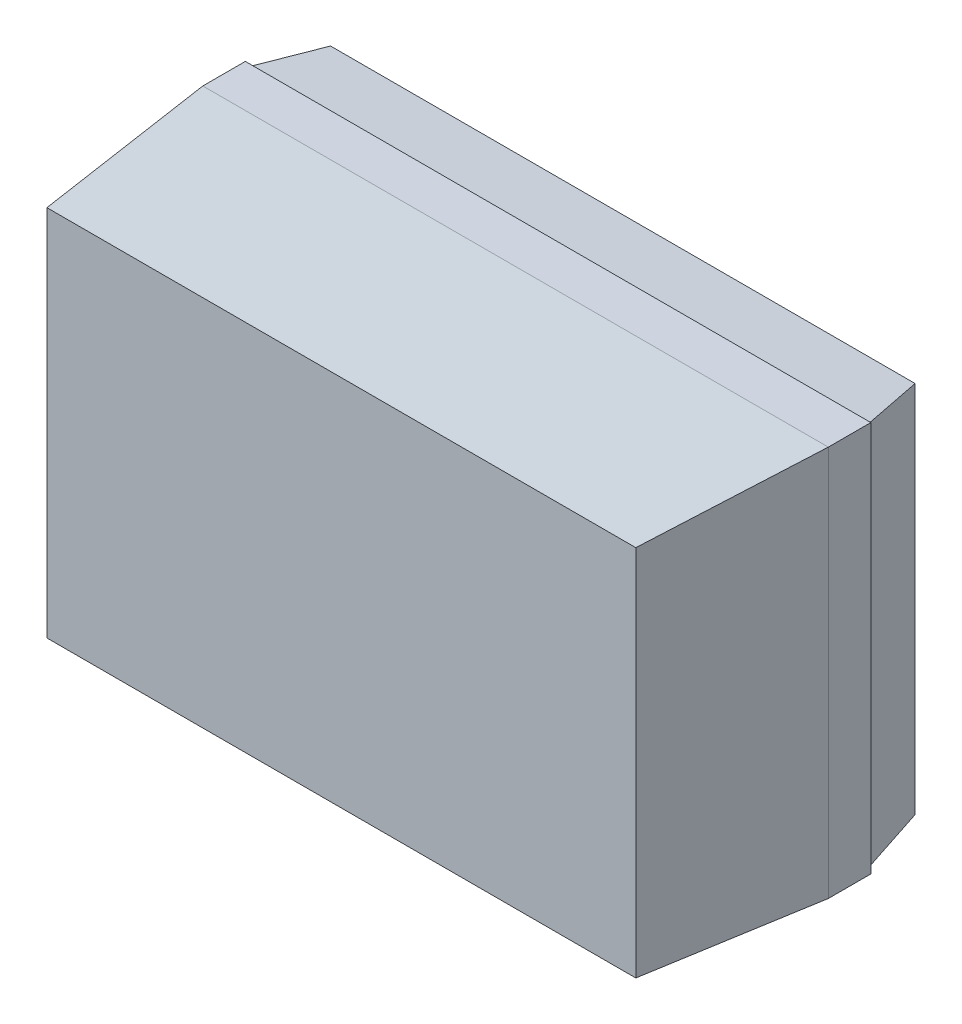
ISO-10303-21;
HEADER;
FILE_DESCRIPTION(('STEP AP214'),'2;1');
FILE_NAME('part.step','',(''),(''),'','','');
FILE_SCHEMA(('AUTOMOTIVE_DESIGN { 1 0 10303 214 1 1 1 1 }'));
ENDSEC;
DATA;
#1=APPLICATION_CONTEXT('core data for automotive mechanical design processes');
#2=APPLICATION_PROTOCOL_DEFINITION('international standard','automotive_design',2000,#1);
#3=PRODUCT_CONTEXT('',#1,'mechanical');
#4=PRODUCT('Part','Part','',(#3));
#5=PRODUCT_RELATED_PRODUCT_CATEGORY('part','',(#4));
#6=PRODUCT_DEFINITION_FORMATION('','',#4);
#7=PRODUCT_DEFINITION_CONTEXT('part definition',#1,'design');
#8=PRODUCT_DEFINITION('design','',#6,#7);
#9=PRODUCT_DEFINITION_SHAPE('','',#8);
#10=(LENGTH_UNIT() NAMED_UNIT(*) SI_UNIT(.MILLI.,.METRE.));
#11=(NAMED_UNIT(*) PLANE_ANGLE_UNIT() SI_UNIT($,.RADIAN.));
#12=(NAMED_UNIT(*) SI_UNIT($,.STERADIAN.) SOLID_ANGLE_UNIT());
#13=UNCERTAINTY_MEASURE_WITH_UNIT(LENGTH_MEASURE(1.E-05),#10,'distance_accuracy_value','');
#14=(GEOMETRIC_REPRESENTATION_CONTEXT(3) GLOBAL_UNCERTAINTY_ASSIGNED_CONTEXT((#13)) GLOBAL_UNIT_ASSIGNED_CONTEXT((#10,
#11,#12)) REPRESENTATION_CONTEXT('',''));
#15=CARTESIAN_POINT('',(0.,0.,0.));
#16=DIRECTION('',(0.,0.,1.));
#17=DIRECTION('',(1.,0.,0.));
#18=AXIS2_PLACEMENT_3D('',#15,#16,#17);
#19=CARTESIAN_POINT('',(1.,0.596889846650134,-0.9));
#20=DIRECTION('',(0.,0.,1.));
#21=DIRECTION('',(0.,-1.,0.));
#22=AXIS2_PLACEMENT_3D('',#19,#20,#21);
#23=PLANE('',#22);
#24=DIRECTION('',(1.,0.,0.));
#25=VECTOR('',#24,1.);
#26=CARTESIAN_POINT('',(1.,-0.596889846650134,-0.9));
#27=LINE('',#26,#25);
#28=CARTESIAN_POINT('',(0.934534517166759,-0.596889846650134,-0.9));
#29=VERTEX_POINT('',#28);
#30=CARTESIAN_POINT('',(-0.934534517166759,-0.596889846650134,-0.9));
#31=VERTEX_POINT('',#30);
#32=EDGE_CURVE('E95',#29,#31,#27,.F.);
#33=ORIENTED_EDGE('',*,*,#32,.T.);
#34=DIRECTION('',(0.,1.,0.));
#35=VECTOR('',#34,1.);
#36=CARTESIAN_POINT('',(-0.934534517166759,-0.625,-0.9));
#37=LINE('',#36,#35);
#38=CARTESIAN_POINT('',(-0.934534517166759,0.596889846650134,-0.9));
#39=VERTEX_POINT('',#38);
#40=EDGE_CURVE('E92',#31,#39,#37,.T.);
#41=ORIENTED_EDGE('',*,*,#40,.T.);
#42=DIRECTION('',(1.,0.,0.));
#43=VECTOR('',#42,1.);
#44=CARTESIAN_POINT('',(1.,0.596889846650134,-0.9));
#45=LINE('',#44,#43);
#46=CARTESIAN_POINT('',(0.934534517166759,0.596889846650134,-0.9));
#47=VERTEX_POINT('',#46);
#48=EDGE_CURVE('E114',#39,#47,#45,.T.);
#49=ORIENTED_EDGE('',*,*,#48,.T.);
#50=DIRECTION('',(0.,-1.,0.));
#51=VECTOR('',#50,1.);
#52=CARTESIAN_POINT('',(0.934534517166759,0.596889846650134,-0.9));
#53=LINE('',#52,#51);
#54=EDGE_CURVE('E20',#29,#47,#53,.F.);
#55=ORIENTED_EDGE('',*,*,#54,.F.);
#56=EDGE_LOOP('',(#33,#41,#49,#55));
#57=FACE_BOUND('',#56,.T.);
#58=ADVANCED_FACE('F17',(#57),#23,.F.);
#59=CARTESIAN_POINT('',(1.,-0.615,-0.693));
#60=DIRECTION('',(0.,0.996194698091746,0.0871557427476585));
#61=DIRECTION('',(0.,-0.0871557427476585,0.996194698091746));
#62=AXIS2_PLACEMENT_3D('',#59,#60,#61);
#63=PLANE('',#62);
#64=DIRECTION('',(1.,0.,0.));
#65=VECTOR('',#64,1.);
#66=CARTESIAN_POINT('',(1.,-0.615,-0.693));
#67=LINE('',#66,#65);
#68=CARTESIAN_POINT('',(0.99,-0.615,-0.693));
#69=VERTEX_POINT('',#68);
#70=CARTESIAN_POINT('',(-0.99,-0.615,-0.693));
#71=VERTEX_POINT('',#70);
#72=EDGE_CURVE('E110',#69,#71,#67,.F.);
#73=ORIENTED_EDGE('',*,*,#72,.T.);
#74=DIRECTION('',(0.25789978419709,0.0842074097641766,-0.962495097884609));
#75=VECTOR('',#74,1.);
#76=CARTESIAN_POINT('',(-0.99,-0.615,-0.693));
#77=LINE('',#76,#75);
#78=EDGE_CURVE('E100',#71,#31,#77,.T.);
#79=ORIENTED_EDGE('',*,*,#78,.T.);
#80=ORIENTED_EDGE('',*,*,#32,.F.);
#81=DIRECTION('',(0.25789978419709,-0.0842074097641766,0.962495097884609));
#82=VECTOR('',#81,1.);
#83=CARTESIAN_POINT('',(0.934534517166759,-0.596889846650134,-0.9));
#84=LINE('',#83,#82);
#85=EDGE_CURVE('E116',#29,#69,#84,.T.);
#86=ORIENTED_EDGE('',*,*,#85,.T.);
#87=EDGE_LOOP('',(#73,#79,#80,#86));
#88=FACE_BOUND('',#87,.T.);
#89=ADVANCED_FACE('F109',(#88),#63,.F.);
#90=CARTESIAN_POINT('',(-0.99,-0.625,-0.693));
#91=DIRECTION('',(0.96592582628907,0.,0.258819045102516));
#92=DIRECTION('',(0.258819045102516,0.,-0.96592582628907));
#93=AXIS2_PLACEMENT_3D('',#90,#91,#92);
#94=PLANE('',#93);
#95=ORIENTED_EDGE('',*,*,#40,.F.);
#96=ORIENTED_EDGE('',*,*,#78,.F.);
#97=DIRECTION('',(0.,1.,0.));
#98=VECTOR('',#97,1.);
#99=CARTESIAN_POINT('',(-0.99,0.625,-0.693));
#100=LINE('',#99,#98);
#101=CARTESIAN_POINT('',(-0.99,0.615,-0.693));
#102=VERTEX_POINT('',#101);
#103=EDGE_CURVE('E124',#71,#102,#100,.T.);
#104=ORIENTED_EDGE('',*,*,#103,.T.);
#105=DIRECTION('',(0.257899784197089,-0.0842074097641781,-0.962495097884609));
#106=VECTOR('',#105,1.);
#107=CARTESIAN_POINT('',(-0.99,0.615,-0.693));
#108=LINE('',#107,#106);
#109=EDGE_CURVE('E106',#102,#39,#108,.T.);
#110=ORIENTED_EDGE('',*,*,#109,.T.);
#111=EDGE_LOOP('',(#95,#96,#104,#110));
#112=FACE_BOUND('',#111,.T.);
#113=ADVANCED_FACE('F103',(#112),#94,.F.);
#114=CARTESIAN_POINT('',(1.,0.615,-0.693));
#115=DIRECTION('',(0.,-0.996194698091746,0.0871557427476585));
#116=DIRECTION('',(0.,-0.0871557427476585,-0.996194698091746));
#117=AXIS2_PLACEMENT_3D('',#114,#115,#116);
#118=PLANE('',#117);
#119=ORIENTED_EDGE('',*,*,#48,.F.);
#120=ORIENTED_EDGE('',*,*,#109,.F.);
#121=DIRECTION('',(1.,0.,0.));
#122=VECTOR('',#121,1.);
#123=CARTESIAN_POINT('',(1.,0.615,-0.693));
#124=LINE('',#123,#122);
#125=CARTESIAN_POINT('',(0.99,0.615,-0.693));
#126=VERTEX_POINT('',#125);
#127=EDGE_CURVE('E126',#102,#126,#124,.T.);
#128=ORIENTED_EDGE('',*,*,#127,.T.);
#129=DIRECTION('',(-0.25789978419709,-0.0842074097641766,-0.962495097884609));
#130=VECTOR('',#129,1.);
#131=CARTESIAN_POINT('',(0.99,0.615,-0.693));
#132=LINE('',#131,#130);
#133=EDGE_CURVE('E118',#126,#47,#132,.T.);
#134=ORIENTED_EDGE('',*,*,#133,.T.);
#135=EDGE_LOOP('',(#119,#120,#128,#134));
#136=FACE_BOUND('',#135,.T.);
#137=ADVANCED_FACE('F231',(#136),#118,.F.);
#138=CARTESIAN_POINT('',(0.99,-0.625,-0.693));
#139=DIRECTION('',(-0.96592582628907,0.,0.258819045102516));
#140=DIRECTION('',(0.258819045102516,0.,0.96592582628907));
#141=AXIS2_PLACEMENT_3D('',#138,#139,#140);
#142=PLANE('',#141);
#143=DIRECTION('',(0.,1.,0.));
#144=VECTOR('',#143,1.);
#145=CARTESIAN_POINT('',(0.99,0.625,-0.693));
#146=LINE('',#145,#144);
#147=EDGE_CURVE('E129',#126,#69,#146,.F.);
#148=ORIENTED_EDGE('',*,*,#147,.T.);
#149=ORIENTED_EDGE('',*,*,#85,.F.);
#150=ORIENTED_EDGE('',*,*,#54,.T.);
#151=ORIENTED_EDGE('',*,*,#133,.F.);
#152=EDGE_LOOP('',(#148,#149,#150,#151));
#153=FACE_BOUND('',#152,.T.);
#154=ADVANCED_FACE('F227',(#153),#142,.F.);
#155=CARTESIAN_POINT('',(1.,0.625,-0.693));
#156=DIRECTION('',(0.,0.,1.));
#157=DIRECTION('',(1.,0.,0.));
#158=AXIS2_PLACEMENT_3D('',#155,#156,#157);
#159=PLANE('',#158);
#160=ORIENTED_EDGE('',*,*,#127,.F.);
#161=ORIENTED_EDGE('',*,*,#103,.F.);
#162=ORIENTED_EDGE('',*,*,#72,.F.);
#163=ORIENTED_EDGE('',*,*,#147,.F.);
#164=EDGE_LOOP('',(#160,#161,#162,#163));
#165=FACE_BOUND('',#164,.T.);
#166=DIRECTION('',(0.,1.,0.));
#167=VECTOR('',#166,1.);
#168=CARTESIAN_POINT('',(1.,0.625,-0.693));
#169=LINE('',#168,#167);
#170=CARTESIAN_POINT('',(1.,-0.625,-0.693));
#171=VERTEX_POINT('',#170);
#172=CARTESIAN_POINT('',(1.,0.625,-0.693));
#173=VERTEX_POINT('',#172);
#174=EDGE_CURVE('E121',#171,#173,#169,.T.);
#175=ORIENTED_EDGE('',*,*,#174,.F.);
#176=DIRECTION('',(1.,0.,0.));
#177=VECTOR('',#176,1.);
#178=CARTESIAN_POINT('',(1.,-0.625,-0.693));
#179=LINE('',#178,#177);
#180=CARTESIAN_POINT('',(-1.,-0.625,-0.693));
#181=VERTEX_POINT('',#180);
#182=EDGE_CURVE('E132',#171,#181,#179,.F.);
#183=ORIENTED_EDGE('',*,*,#182,.T.);
#184=DIRECTION('',(0.,1.,0.));
#185=VECTOR('',#184,1.);
#186=CARTESIAN_POINT('',(-1.,0.595808866939335,-0.693));
#187=LINE('',#186,#185);
#188=CARTESIAN_POINT('',(-1.,0.625,-0.693));
#189=VERTEX_POINT('',#188);
#190=EDGE_CURVE('E137',#181,#189,#187,.T.);
#191=ORIENTED_EDGE('',*,*,#190,.T.);
#192=DIRECTION('',(1.,0.,0.));
#193=VECTOR('',#192,1.);
#194=CARTESIAN_POINT('',(1.,0.625,-0.693));
#195=LINE('',#194,#193);
#196=EDGE_CURVE('E142',#189,#173,#195,.T.);
#197=ORIENTED_EDGE('',*,*,#196,.T.);
#198=EDGE_LOOP('',(#175,#183,#191,#197));
#199=FACE_BOUND('',#198,.T.);
#200=ADVANCED_FACE('F223',(#165,#199),#159,.F.);
#201=CARTESIAN_POINT('',(1.,-0.625,-0.557));
#202=DIRECTION('',(0.,1.,0.));
#203=DIRECTION('',(0.,0.,1.));
#204=AXIS2_PLACEMENT_3D('',#201,#202,#203);
#205=PLANE('',#204);
#206=DIRECTION('',(0.,0.,-1.));
#207=VECTOR('',#206,1.);
#208=CARTESIAN_POINT('',(1.,-0.625,0.));
#209=LINE('',#208,#207);
#210=CARTESIAN_POINT('',(1.,-0.625,-0.557));
#211=VERTEX_POINT('',#210);
#212=EDGE_CURVE('E145',#211,#171,#209,.T.);
#213=ORIENTED_EDGE('',*,*,#212,.F.);
#214=DIRECTION('',(1.,0.,0.));
#215=VECTOR('',#214,1.);
#216=CARTESIAN_POINT('',(1.,-0.625000000000001,-0.557));
#217=LINE('',#216,#215);
#218=CARTESIAN_POINT('',(-1.,-0.625,-0.557));
#219=VERTEX_POINT('',#218);
#220=EDGE_CURVE('E150',#211,#219,#217,.F.);
#221=ORIENTED_EDGE('',*,*,#220,.T.);
#222=DIRECTION('',(0.,0.,-1.));
#223=VECTOR('',#222,1.);
#224=CARTESIAN_POINT('',(-1.,-0.625,0.));
#225=LINE('',#224,#223);
#226=EDGE_CURVE('E134',#219,#181,#225,.T.);
#227=ORIENTED_EDGE('',*,*,#226,.T.);
#228=ORIENTED_EDGE('',*,*,#182,.F.);
#229=EDGE_LOOP('',(#213,#221,#227,#228));
#230=FACE_BOUND('',#229,.T.);
#231=ADVANCED_FACE('F219',(#230),#205,.F.);
#232=CARTESIAN_POINT('',(-1.,0.595808866939335,0.));
#233=DIRECTION('',(1.,0.,0.));
#234=DIRECTION('',(0.,0.,-1.));
#235=AXIS2_PLACEMENT_3D('',#232,#233,#234);
#236=PLANE('',#235);
#237=DIRECTION('',(0.,0.,-1.));
#238=VECTOR('',#237,1.);
#239=CARTESIAN_POINT('',(-1.,0.625,-0.557));
#240=LINE('',#239,#238);
#241=CARTESIAN_POINT('',(-1.,0.625,-0.557));
#242=VERTEX_POINT('',#241);
#243=EDGE_CURVE('E139',#242,#189,#240,.T.);
#244=ORIENTED_EDGE('',*,*,#243,.T.);
#245=ORIENTED_EDGE('',*,*,#190,.F.);
#246=ORIENTED_EDGE('',*,*,#226,.F.);
#247=DIRECTION('',(0.,1.,0.));
#248=VECTOR('',#247,1.);
#249=CARTESIAN_POINT('',(-1.,-0.625,-0.557));
#250=LINE('',#249,#248);
#251=EDGE_CURVE('E153',#219,#242,#250,.T.);
#252=ORIENTED_EDGE('',*,*,#251,.T.);
#253=EDGE_LOOP('',(#244,#245,#246,#252));
#254=FACE_BOUND('',#253,.T.);
#255=ADVANCED_FACE('F215',(#254),#236,.F.);
#256=CARTESIAN_POINT('',(1.,0.625,-0.557));
#257=DIRECTION('',(0.,-1.,0.));
#258=DIRECTION('',(0.,0.,-1.));
#259=AXIS2_PLACEMENT_3D('',#256,#257,#258);
#260=PLANE('',#259);
#261=DIRECTION('',(0.,0.,-1.));
#262=VECTOR('',#261,1.);
#263=CARTESIAN_POINT('',(1.,0.625,0.));
#264=LINE('',#263,#262);
#265=CARTESIAN_POINT('',(1.,0.625,-0.557));
#266=VERTEX_POINT('',#265);
#267=EDGE_CURVE('E148',#173,#266,#264,.F.);
#268=ORIENTED_EDGE('',*,*,#267,.F.);
#269=ORIENTED_EDGE('',*,*,#196,.F.);
#270=ORIENTED_EDGE('',*,*,#243,.F.);
#271=DIRECTION('',(1.,0.,0.));
#272=VECTOR('',#271,1.);
#273=CARTESIAN_POINT('',(1.,0.625,-0.557));
#274=LINE('',#273,#272);
#275=EDGE_CURVE('E162',#242,#266,#274,.T.);
#276=ORIENTED_EDGE('',*,*,#275,.T.);
#277=EDGE_LOOP('',(#268,#269,#270,#276));
#278=FACE_BOUND('',#277,.T.);
#279=ADVANCED_FACE('F211',(#278),#260,.F.);
#280=CARTESIAN_POINT('',(1.,0.595808866939335,0.));
#281=DIRECTION('',(1.,0.,0.));
#282=DIRECTION('',(0.,0.,-1.));
#283=AXIS2_PLACEMENT_3D('',#280,#281,#282);
#284=PLANE('',#283);
#285=ORIENTED_EDGE('',*,*,#174,.T.);
#286=ORIENTED_EDGE('',*,*,#267,.T.);
#287=DIRECTION('',(0.,1.,0.));
#288=VECTOR('',#287,1.);
#289=CARTESIAN_POINT('',(1.,-0.625,-0.557));
#290=LINE('',#289,#288);
#291=EDGE_CURVE('E166',#266,#211,#290,.F.);
#292=ORIENTED_EDGE('',*,*,#291,.T.);
#293=ORIENTED_EDGE('',*,*,#212,.T.);
#294=EDGE_LOOP('',(#285,#286,#292,#293));
#295=FACE_BOUND('',#294,.T.);
#296=ADVANCED_FACE('F208',(#295),#284,.T.);
#297=CARTESIAN_POINT('',(1.,-0.595808866939336,0.));
#298=DIRECTION('',(0.,0.998629534754573,-0.0523359562429629));
#299=DIRECTION('',(0.,0.0523359562429629,0.998629534754573));
#300=AXIS2_PLACEMENT_3D('',#297,#298,#299);
#301=PLANE('',#300);
#302=DIRECTION('',(1.,0.,0.));
#303=VECTOR('',#302,1.);
#304=CARTESIAN_POINT('',(1.,-0.595808866939336,0.));
#305=LINE('',#304,#303);
#306=CARTESIAN_POINT('',(0.941456940957022,-0.595808866939336,0.));
#307=VERTEX_POINT('',#306);
#308=CARTESIAN_POINT('',(-0.941456940957022,-0.595808866939336,0.));
#309=VERTEX_POINT('',#308);
#310=EDGE_CURVE('E172',#307,#309,#305,.F.);
#311=ORIENTED_EDGE('',*,*,#310,.T.);
#312=DIRECTION('',(-0.104386772667309,-0.052050033266415,-0.993173799356925));
#313=VECTOR('',#312,1.);
#314=CARTESIAN_POINT('',(-0.941456940957022,-0.595808866939336,0.));
#315=LINE('',#314,#313);
#316=EDGE_CURVE('E156',#309,#219,#315,.T.);
#317=ORIENTED_EDGE('',*,*,#316,.T.);
#318=ORIENTED_EDGE('',*,*,#220,.F.);
#319=DIRECTION('',(-0.104386772667309,0.052050033266415,0.993173799356925));
#320=VECTOR('',#319,1.);
#321=CARTESIAN_POINT('',(1.,-0.625,-0.557));
#322=LINE('',#321,#320);
#323=EDGE_CURVE('E169',#211,#307,#322,.T.);
#324=ORIENTED_EDGE('',*,*,#323,.T.);
#325=EDGE_LOOP('',(#311,#317,#318,#324));
#326=FACE_BOUND('',#325,.T.);
#327=ADVANCED_FACE('F190',(#326),#301,.F.);
#328=CARTESIAN_POINT('',(-0.941456940957022,-0.625,0.));
#329=DIRECTION('',(0.994521895368274,0.,-0.104528463267647));
#330=DIRECTION('',(-0.104528463267647,0.,-0.994521895368274));
#331=AXIS2_PLACEMENT_3D('',#328,#329,#330);
#332=PLANE('',#331);
#333=DIRECTION('',(0.,1.,0.));
#334=VECTOR('',#333,1.);
#335=CARTESIAN_POINT('',(-0.941456940957022,-0.595808866939336,0.));
#336=LINE('',#335,#334);
#337=CARTESIAN_POINT('',(-0.941456940957022,0.595808866939336,0.));
#338=VERTEX_POINT('',#337);
#339=EDGE_CURVE('E175',#309,#338,#336,.T.);
#340=ORIENTED_EDGE('',*,*,#339,.T.);
#341=DIRECTION('',(-0.104386772667309,0.0520500332664162,-0.993173799356925));
#342=VECTOR('',#341,1.);
#343=CARTESIAN_POINT('',(-0.941456940957022,0.595808866939335,0.));
#344=LINE('',#343,#342);
#345=EDGE_CURVE('E159',#338,#242,#344,.T.);
#346=ORIENTED_EDGE('',*,*,#345,.T.);
#347=ORIENTED_EDGE('',*,*,#251,.F.);
#348=ORIENTED_EDGE('',*,*,#316,.F.);
#349=EDGE_LOOP('',(#340,#346,#347,#348));
#350=FACE_BOUND('',#349,.T.);
#351=ADVANCED_FACE('F187',(#350),#332,.F.);
#352=CARTESIAN_POINT('',(1.,0.595808866939335,0.));
#353=DIRECTION('',(0.,-0.998629534754573,-0.0523359562429629));
#354=DIRECTION('',(0.,0.0523359562429629,-0.998629534754573));
#355=AXIS2_PLACEMENT_3D('',#352,#353,#354);
#356=PLANE('',#355);
#357=ORIENTED_EDGE('',*,*,#275,.F.);
#358=ORIENTED_EDGE('',*,*,#345,.F.);
#359=DIRECTION('',(1.,0.,0.));
#360=VECTOR('',#359,1.);
#361=CARTESIAN_POINT('',(1.,0.595808866939336,0.));
#362=LINE('',#361,#360);
#363=CARTESIAN_POINT('',(0.941456940957022,0.595808866939335,0.));
#364=VERTEX_POINT('',#363);
#365=EDGE_CURVE('E26',#338,#364,#362,.T.);
#366=ORIENTED_EDGE('',*,*,#365,.T.);
#367=DIRECTION('',(0.104386772667309,0.0520500332664171,-0.993173799356924));
#368=VECTOR('',#367,1.);
#369=CARTESIAN_POINT('',(0.941456940957022,0.595808866939335,0.));
#370=LINE('',#369,#368);
#371=EDGE_CURVE('E34',#364,#266,#370,.T.);
#372=ORIENTED_EDGE('',*,*,#371,.T.);
#373=EDGE_LOOP('',(#357,#358,#366,#372));
#374=FACE_BOUND('',#373,.T.);
#375=ADVANCED_FACE('F182',(#374),#356,.F.);
#376=CARTESIAN_POINT('',(0.941456940957022,-0.625,0.));
#377=DIRECTION('',(-0.994521895368274,0.,-0.104528463267647));
#378=DIRECTION('',(-0.104528463267647,0.,0.994521895368274));
#379=AXIS2_PLACEMENT_3D('',#376,#377,#378);
#380=PLANE('',#379);
#381=ORIENTED_EDGE('',*,*,#291,.F.);
#382=ORIENTED_EDGE('',*,*,#371,.F.);
#383=DIRECTION('',(0.,1.,0.));
#384=VECTOR('',#383,1.);
#385=CARTESIAN_POINT('',(0.941456940957022,-0.595808866939336,0.));
#386=LINE('',#385,#384);
#387=EDGE_CURVE('E11',#364,#307,#386,.F.);
#388=ORIENTED_EDGE('',*,*,#387,.T.);
#389=ORIENTED_EDGE('',*,*,#323,.F.);
#390=EDGE_LOOP('',(#381,#382,#388,#389));
#391=FACE_BOUND('',#390,.T.);
#392=ADVANCED_FACE('F193',(#391),#380,.F.);
#393=CARTESIAN_POINT('',(1.,-0.595808866939336,0.));
#394=DIRECTION('',(0.,0.,-1.));
#395=DIRECTION('',(0.,1.,0.));
#396=AXIS2_PLACEMENT_3D('',#393,#394,#395);
#397=PLANE('',#396);
#398=ORIENTED_EDGE('',*,*,#365,.F.);
#399=ORIENTED_EDGE('',*,*,#339,.F.);
#400=ORIENTED_EDGE('',*,*,#310,.F.);
#401=ORIENTED_EDGE('',*,*,#387,.F.);
#402=EDGE_LOOP('',(#398,#399,#400,#401));
#403=FACE_BOUND('',#402,.T.);
#404=ADVANCED_FACE('F185',(#403),#397,.F.);
#405=CLOSED_SHELL('',(#58,#89,#113,#137,#154,#200,#231,#255,#279,#296,#327,#351,#375,#392,#404));
#406=MANIFOLD_SOLID_BREP('B1',#405);
#407=ADVANCED_BREP_SHAPE_REPRESENTATION('',(#18,#406),#14);
#408=SHAPE_DEFINITION_REPRESENTATION(#9,#407);
ENDSEC;
END-ISO-10303-21;
